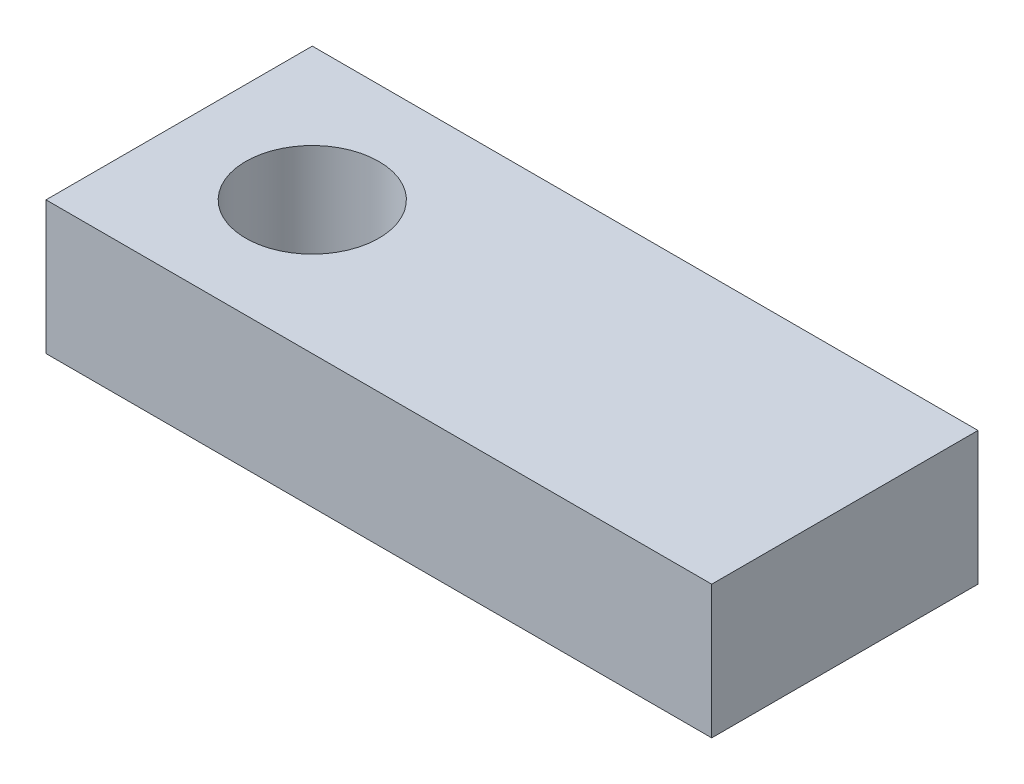
ISO-10303-21;
HEADER;
FILE_DESCRIPTION(('STEP AP214'),'2;1');
FILE_NAME('part.step','',(''),(''),'','','');
FILE_SCHEMA(('AUTOMOTIVE_DESIGN { 1 0 10303 214 1 1 1 1 }'));
ENDSEC;
DATA;
#1=APPLICATION_CONTEXT('core data for automotive mechanical design processes');
#2=APPLICATION_PROTOCOL_DEFINITION('international standard','automotive_design',2000,#1);
#3=PRODUCT_CONTEXT('',#1,'mechanical');
#4=PRODUCT('Part','Part','',(#3));
#5=PRODUCT_RELATED_PRODUCT_CATEGORY('part','',(#4));
#6=PRODUCT_DEFINITION_FORMATION('','',#4);
#7=PRODUCT_DEFINITION_CONTEXT('part definition',#1,'design');
#8=PRODUCT_DEFINITION('design','',#6,#7);
#9=PRODUCT_DEFINITION_SHAPE('','',#8);
#10=(LENGTH_UNIT() NAMED_UNIT(*) SI_UNIT(.MILLI.,.METRE.));
#11=(NAMED_UNIT(*) PLANE_ANGLE_UNIT() SI_UNIT($,.RADIAN.));
#12=(NAMED_UNIT(*) SI_UNIT($,.STERADIAN.) SOLID_ANGLE_UNIT());
#13=UNCERTAINTY_MEASURE_WITH_UNIT(LENGTH_MEASURE(1.E-05),#10,'distance_accuracy_value','');
#14=(GEOMETRIC_REPRESENTATION_CONTEXT(3) GLOBAL_UNCERTAINTY_ASSIGNED_CONTEXT((#13)) GLOBAL_UNIT_ASSIGNED_CONTEXT((#10,
#11,#12)) REPRESENTATION_CONTEXT('',''));
#15=CARTESIAN_POINT('',(0.,0.,0.));
#16=DIRECTION('',(0.,0.,1.));
#17=DIRECTION('',(1.,0.,0.));
#18=AXIS2_PLACEMENT_3D('',#15,#16,#17);
#19=CARTESIAN_POINT('',(0.,25.4,0.));
#20=DIRECTION('',(1.,0.,0.));
#21=DIRECTION('',(0.,0.,-1.));
#22=AXIS2_PLACEMENT_3D('',#19,#20,#21);
#23=PLANE('',#22);
#24=DIRECTION('',(0.,0.,1.));
#25=VECTOR('',#24,1.);
#26=CARTESIAN_POINT('',(0.,0.,0.));
#27=LINE('',#26,#25);
#28=CARTESIAN_POINT('',(0.,0.,-50.8));
#29=VERTEX_POINT('',#28);
#30=CARTESIAN_POINT('',(0.,0.,0.));
#31=VERTEX_POINT('',#30);
#32=EDGE_CURVE('E80',#29,#31,#27,.T.);
#33=ORIENTED_EDGE('',*,*,#32,.T.);
#34=DIRECTION('',(0.,-1.,0.));
#35=VECTOR('',#34,1.);
#36=CARTESIAN_POINT('',(0.,25.4,0.));
#37=LINE('',#36,#35);
#38=CARTESIAN_POINT('',(0.,25.4,0.));
#39=VERTEX_POINT('',#38);
#40=EDGE_CURVE('E11',#39,#31,#37,.T.);
#41=ORIENTED_EDGE('',*,*,#40,.F.);
#42=DIRECTION('',(0.,0.,1.));
#43=VECTOR('',#42,1.);
#44=CARTESIAN_POINT('',(0.,25.4,0.));
#45=LINE('',#44,#43);
#46=CARTESIAN_POINT('',(0.,25.4,-50.8));
#47=VERTEX_POINT('',#46);
#48=EDGE_CURVE('E68',#47,#39,#45,.T.);
#49=ORIENTED_EDGE('',*,*,#48,.F.);
#50=DIRECTION('',(0.,-1.,0.));
#51=VECTOR('',#50,1.);
#52=CARTESIAN_POINT('',(0.,25.4,-50.8));
#53=LINE('',#52,#51);
#54=EDGE_CURVE('E76',#47,#29,#53,.T.);
#55=ORIENTED_EDGE('',*,*,#54,.T.);
#56=EDGE_LOOP('',(#33,#41,#49,#55));
#57=FACE_BOUND('',#56,.T.);
#58=ADVANCED_FACE('F17',(#57),#23,.F.);
#59=CARTESIAN_POINT('',(0.,25.4,0.));
#60=DIRECTION('',(0.,0.,-1.));
#61=DIRECTION('',(-1.,0.,0.));
#62=AXIS2_PLACEMENT_3D('',#59,#60,#61);
#63=PLANE('',#62);
#64=DIRECTION('',(1.,0.,0.));
#65=VECTOR('',#64,1.);
#66=CARTESIAN_POINT('',(0.,0.,0.));
#67=LINE('',#66,#65);
#68=CARTESIAN_POINT('',(127.,0.,0.));
#69=VERTEX_POINT('',#68);
#70=EDGE_CURVE('E72',#31,#69,#67,.T.);
#71=ORIENTED_EDGE('',*,*,#70,.T.);
#72=DIRECTION('',(0.,-1.,0.));
#73=VECTOR('',#72,1.);
#74=CARTESIAN_POINT('',(127.,25.4,0.));
#75=LINE('',#74,#73);
#76=CARTESIAN_POINT('',(127.,25.4,0.));
#77=VERTEX_POINT('',#76);
#78=EDGE_CURVE('E25',#77,#69,#75,.T.);
#79=ORIENTED_EDGE('',*,*,#78,.F.);
#80=DIRECTION('',(1.,0.,0.));
#81=VECTOR('',#80,1.);
#82=CARTESIAN_POINT('',(0.,25.4,0.));
#83=LINE('',#82,#81);
#84=EDGE_CURVE('E63',#39,#77,#83,.T.);
#85=ORIENTED_EDGE('',*,*,#84,.F.);
#86=ORIENTED_EDGE('',*,*,#40,.T.);
#87=EDGE_LOOP('',(#71,#79,#85,#86));
#88=FACE_BOUND('',#87,.T.);
#89=ADVANCED_FACE('F71',(#88),#63,.F.);
#90=CARTESIAN_POINT('',(127.,25.4,0.));
#91=DIRECTION('',(-1.,0.,0.));
#92=DIRECTION('',(0.,0.,1.));
#93=AXIS2_PLACEMENT_3D('',#90,#91,#92);
#94=PLANE('',#93);
#95=DIRECTION('',(0.,0.,-1.));
#96=VECTOR('',#95,1.);
#97=CARTESIAN_POINT('',(127.,0.,0.));
#98=LINE('',#97,#96);
#99=CARTESIAN_POINT('',(127.,0.,-50.8));
#100=VERTEX_POINT('',#99);
#101=EDGE_CURVE('E50',#69,#100,#98,.T.);
#102=ORIENTED_EDGE('',*,*,#101,.T.);
#103=DIRECTION('',(0.,-1.,0.));
#104=VECTOR('',#103,1.);
#105=CARTESIAN_POINT('',(127.,25.4,-50.8));
#106=LINE('',#105,#104);
#107=CARTESIAN_POINT('',(127.,25.4,-50.8));
#108=VERTEX_POINT('',#107);
#109=EDGE_CURVE('E73',#108,#100,#106,.T.);
#110=ORIENTED_EDGE('',*,*,#109,.F.);
#111=DIRECTION('',(0.,0.,-1.));
#112=VECTOR('',#111,1.);
#113=CARTESIAN_POINT('',(127.,25.4,0.));
#114=LINE('',#113,#112);
#115=EDGE_CURVE('E66',#77,#108,#114,.T.);
#116=ORIENTED_EDGE('',*,*,#115,.F.);
#117=ORIENTED_EDGE('',*,*,#78,.T.);
#118=EDGE_LOOP('',(#102,#110,#116,#117));
#119=FACE_BOUND('',#118,.T.);
#120=ADVANCED_FACE('F74',(#119),#94,.F.);
#121=CARTESIAN_POINT('',(0.,25.4,-50.8));
#122=DIRECTION('',(0.,0.,1.));
#123=DIRECTION('',(1.,0.,0.));
#124=AXIS2_PLACEMENT_3D('',#121,#122,#123);
#125=PLANE('',#124);
#126=DIRECTION('',(-1.,0.,0.));
#127=VECTOR('',#126,1.);
#128=CARTESIAN_POINT('',(0.,0.,-50.8));
#129=LINE('',#128,#127);
#130=EDGE_CURVE('E56',#100,#29,#129,.T.);
#131=ORIENTED_EDGE('',*,*,#130,.T.);
#132=ORIENTED_EDGE('',*,*,#54,.F.);
#133=DIRECTION('',(-1.,0.,0.));
#134=VECTOR('',#133,1.);
#135=CARTESIAN_POINT('',(0.,25.4,-50.8));
#136=LINE('',#135,#134);
#137=EDGE_CURVE('E33',#108,#47,#136,.T.);
#138=ORIENTED_EDGE('',*,*,#137,.F.);
#139=ORIENTED_EDGE('',*,*,#109,.T.);
#140=EDGE_LOOP('',(#131,#132,#138,#139));
#141=FACE_BOUND('',#140,.T.);
#142=ADVANCED_FACE('F88',(#141),#125,.F.);
#143=CARTESIAN_POINT('',(0.,25.4,-50.8));
#144=DIRECTION('',(0.,-1.,0.));
#145=DIRECTION('',(0.,0.,-1.));
#146=AXIS2_PLACEMENT_3D('',#143,#144,#145);
#147=PLANE('',#146);
#148=CARTESIAN_POINT('',(25.4,25.4,-25.4));
#149=DIRECTION('',(0.,-1.,0.));
#150=DIRECTION('',(0.,0.,-1.));
#151=AXIS2_PLACEMENT_3D('',#148,#149,#150);
#152=CIRCLE('',#151,12.7);
#153=CARTESIAN_POINT('',(25.4,25.4,-38.1));
#154=VERTEX_POINT('',#153);
#155=EDGE_CURVE('E83',#154,#154,#152,.F.);
#156=ORIENTED_EDGE('',*,*,#155,.F.);
#157=EDGE_LOOP('',(#156));
#158=FACE_BOUND('',#157,.T.);
#159=ORIENTED_EDGE('',*,*,#48,.T.);
#160=ORIENTED_EDGE('',*,*,#84,.T.);
#161=ORIENTED_EDGE('',*,*,#115,.T.);
#162=ORIENTED_EDGE('',*,*,#137,.T.);
#163=EDGE_LOOP('',(#159,#160,#161,#162));
#164=FACE_BOUND('',#163,.T.);
#165=ADVANCED_FACE('F64',(#158,#164),#147,.F.);
#166=CARTESIAN_POINT('',(0.,0.,-50.8));
#167=DIRECTION('',(0.,-1.,0.));
#168=DIRECTION('',(0.,0.,-1.));
#169=AXIS2_PLACEMENT_3D('',#166,#167,#168);
#170=PLANE('',#169);
#171=CARTESIAN_POINT('',(25.4,0.,-25.4));
#172=DIRECTION('',(0.,-1.,0.));
#173=DIRECTION('',(0.,0.,-1.));
#174=AXIS2_PLACEMENT_3D('',#171,#172,#173);
#175=CIRCLE('',#174,12.7);
#176=CARTESIAN_POINT('',(25.4,0.,-38.1));
#177=VERTEX_POINT('',#176);
#178=EDGE_CURVE('E96',#177,#177,#175,.T.);
#179=ORIENTED_EDGE('',*,*,#178,.F.);
#180=EDGE_LOOP('',(#179));
#181=FACE_BOUND('',#180,.T.);
#182=ORIENTED_EDGE('',*,*,#32,.F.);
#183=ORIENTED_EDGE('',*,*,#130,.F.);
#184=ORIENTED_EDGE('',*,*,#101,.F.);
#185=ORIENTED_EDGE('',*,*,#70,.F.);
#186=EDGE_LOOP('',(#182,#183,#184,#185));
#187=FACE_BOUND('',#186,.T.);
#188=ADVANCED_FACE('F91',(#181,#187),#170,.T.);
#189=CARTESIAN_POINT('',(25.4,25.401,-25.4));
#190=DIRECTION('',(0.,-1.,0.));
#191=DIRECTION('',(0.,0.,-1.));
#192=AXIS2_PLACEMENT_3D('',#189,#190,#191);
#193=CYLINDRICAL_SURFACE('',#192,12.7);
#194=ORIENTED_EDGE('',*,*,#178,.T.);
#195=EDGE_LOOP('',(#194));
#196=FACE_BOUND('',#195,.T.);
#197=ORIENTED_EDGE('',*,*,#155,.T.);
#198=EDGE_LOOP('',(#197));
#199=FACE_BOUND('',#198,.T.);
#200=ADVANCED_FACE('F100',(#196,#199),#193,.F.);
#201=CLOSED_SHELL('',(#58,#89,#120,#142,#165,#188,#200));
#202=MANIFOLD_SOLID_BREP('B1',#201);
#203=ADVANCED_BREP_SHAPE_REPRESENTATION('',(#18,#202),#14);
#204=SHAPE_DEFINITION_REPRESENTATION(#9,#203);
ENDSEC;
END-ISO-10303-21;
